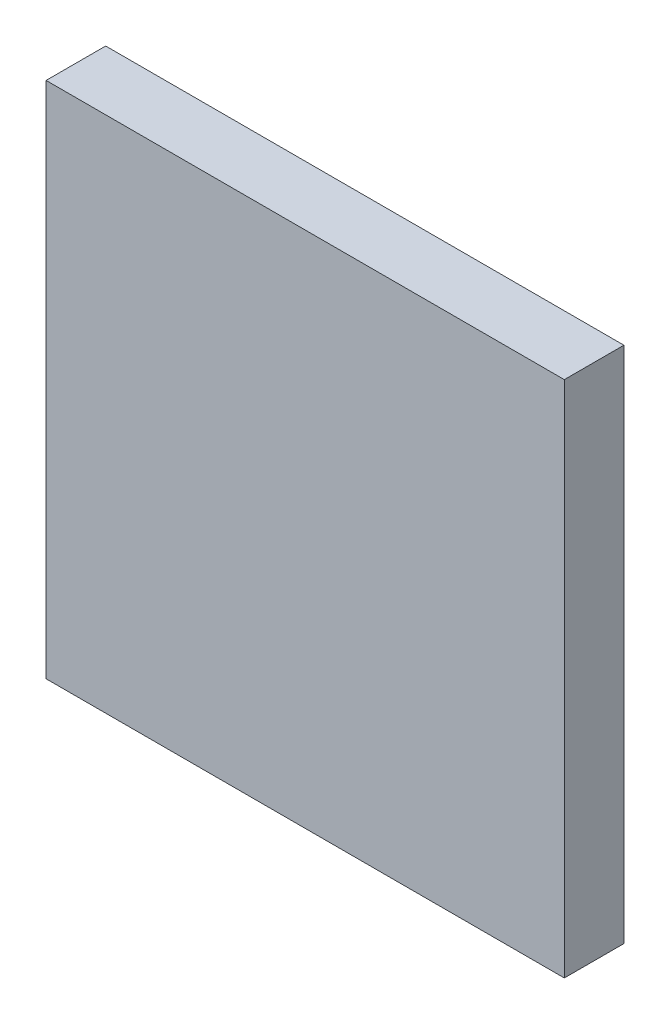
ISO-10303-21;
HEADER;
FILE_DESCRIPTION(('STEP AP214'),'2;1');
FILE_NAME('part.step','',(''),(''),'','','');
FILE_SCHEMA(('AUTOMOTIVE_DESIGN { 1 0 10303 214 1 1 1 1 }'));
ENDSEC;
DATA;
#1=APPLICATION_CONTEXT('core data for automotive mechanical design processes');
#2=APPLICATION_PROTOCOL_DEFINITION('international standard','automotive_design',2000,#1);
#3=PRODUCT_CONTEXT('',#1,'mechanical');
#4=PRODUCT('Part','Part','',(#3));
#5=PRODUCT_RELATED_PRODUCT_CATEGORY('part','',(#4));
#6=PRODUCT_DEFINITION_FORMATION('','',#4);
#7=PRODUCT_DEFINITION_CONTEXT('part definition',#1,'design');
#8=PRODUCT_DEFINITION('design','',#6,#7);
#9=PRODUCT_DEFINITION_SHAPE('','',#8);
#10=(LENGTH_UNIT() NAMED_UNIT(*) SI_UNIT(.MILLI.,.METRE.));
#11=(NAMED_UNIT(*) PLANE_ANGLE_UNIT() SI_UNIT($,.RADIAN.));
#12=(NAMED_UNIT(*) SI_UNIT($,.STERADIAN.) SOLID_ANGLE_UNIT());
#13=UNCERTAINTY_MEASURE_WITH_UNIT(LENGTH_MEASURE(1.E-05),#10,'distance_accuracy_value','');
#14=(GEOMETRIC_REPRESENTATION_CONTEXT(3) GLOBAL_UNCERTAINTY_ASSIGNED_CONTEXT((#13)) GLOBAL_UNIT_ASSIGNED_CONTEXT((#10,
#11,#12)) REPRESENTATION_CONTEXT('',''));
#15=CARTESIAN_POINT('',(0.,0.,0.));
#16=DIRECTION('',(0.,0.,1.));
#17=DIRECTION('',(1.,0.,0.));
#18=AXIS2_PLACEMENT_3D('',#15,#16,#17);
#19=CARTESIAN_POINT('',(5.00000016,5.00000016,1.15000024));
#20=DIRECTION('',(0.,0.,1.));
#21=DIRECTION('',(1.,0.,0.));
#22=AXIS2_PLACEMENT_3D('',#19,#20,#21);
#23=PLANE('',#22);
#24=DIRECTION('',(1.,0.,0.));
#25=VECTOR('',#24,1.);
#26=CARTESIAN_POINT('',(5.00000016,-5.00000016,1.15000024));
#27=LINE('',#26,#25);
#28=CARTESIAN_POINT('',(5.00000016,-5.00000016,1.15000024));
#29=VERTEX_POINT('',#28);
#30=CARTESIAN_POINT('',(-5.00000016,-5.00000016,1.15000024));
#31=VERTEX_POINT('',#30);
#32=EDGE_CURVE('E53',#29,#31,#27,.F.);
#33=ORIENTED_EDGE('',*,*,#32,.F.);
#34=DIRECTION('',(0.,1.,0.));
#35=VECTOR('',#34,1.);
#36=CARTESIAN_POINT('',(5.00000016,5.00000016,1.15000024));
#37=LINE('',#36,#35);
#38=CARTESIAN_POINT('',(5.00000016,5.00000016,1.15000024));
#39=VERTEX_POINT('',#38);
#40=EDGE_CURVE('E68',#39,#29,#37,.F.);
#41=ORIENTED_EDGE('',*,*,#40,.F.);
#42=DIRECTION('',(1.,0.,0.));
#43=VECTOR('',#42,1.);
#44=CARTESIAN_POINT('',(-5.00000016,5.00000016,1.15000024));
#45=LINE('',#44,#43);
#46=CARTESIAN_POINT('',(-5.00000016,5.00000016,1.15000024));
#47=VERTEX_POINT('',#46);
#48=EDGE_CURVE('E20',#47,#39,#45,.T.);
#49=ORIENTED_EDGE('',*,*,#48,.F.);
#50=DIRECTION('',(0.,1.,0.));
#51=VECTOR('',#50,1.);
#52=CARTESIAN_POINT('',(-5.00000016,-5.00000016,1.15000024));
#53=LINE('',#52,#51);
#54=EDGE_CURVE('E58',#31,#47,#53,.T.);
#55=ORIENTED_EDGE('',*,*,#54,.F.);
#56=EDGE_LOOP('',(#33,#41,#49,#55));
#57=FACE_BOUND('',#56,.T.);
#58=ADVANCED_FACE('F17',(#57),#23,.T.);
#59=CARTESIAN_POINT('',(-5.00000016,5.00000016,0.));
#60=DIRECTION('',(0.,1.,0.));
#61=DIRECTION('',(0.,0.,1.));
#62=AXIS2_PLACEMENT_3D('',#59,#60,#61);
#63=PLANE('',#62);
#64=DIRECTION('',(0.,0.,-1.));
#65=VECTOR('',#64,1.);
#66=CARTESIAN_POINT('',(5.00000016,5.00000016,0.));
#67=LINE('',#66,#65);
#68=CARTESIAN_POINT('',(5.00000016,5.00000016,0.));
#69=VERTEX_POINT('',#68);
#70=EDGE_CURVE('E79',#69,#39,#67,.F.);
#71=ORIENTED_EDGE('',*,*,#70,.F.);
#72=DIRECTION('',(1.,0.,0.));
#73=VECTOR('',#72,1.);
#74=CARTESIAN_POINT('',(5.00000016,5.00000016,0.));
#75=LINE('',#74,#73);
#76=CARTESIAN_POINT('',(-5.00000016,5.00000016,0.));
#77=VERTEX_POINT('',#76);
#78=EDGE_CURVE('E74',#69,#77,#75,.F.);
#79=ORIENTED_EDGE('',*,*,#78,.T.);
#80=DIRECTION('',(0.,0.,1.));
#81=VECTOR('',#80,1.);
#82=CARTESIAN_POINT('',(-5.00000016,5.00000016,0.));
#83=LINE('',#82,#81);
#84=EDGE_CURVE('E63',#47,#77,#83,.F.);
#85=ORIENTED_EDGE('',*,*,#84,.F.);
#86=ORIENTED_EDGE('',*,*,#48,.T.);
#87=EDGE_LOOP('',(#71,#79,#85,#86));
#88=FACE_BOUND('',#87,.T.);
#89=ADVANCED_FACE('F73',(#88),#63,.T.);
#90=CARTESIAN_POINT('',(-5.00000016,-5.00000016,0.));
#91=DIRECTION('',(-1.,0.,0.));
#92=DIRECTION('',(0.,0.,1.));
#93=AXIS2_PLACEMENT_3D('',#90,#91,#92);
#94=PLANE('',#93);
#95=ORIENTED_EDGE('',*,*,#84,.T.);
#96=DIRECTION('',(0.,1.,0.));
#97=VECTOR('',#96,1.);
#98=CARTESIAN_POINT('',(-5.00000016,5.00000016,0.));
#99=LINE('',#98,#97);
#100=CARTESIAN_POINT('',(-5.00000016,-5.00000016,0.));
#101=VERTEX_POINT('',#100);
#102=EDGE_CURVE('E84',#77,#101,#99,.F.);
#103=ORIENTED_EDGE('',*,*,#102,.T.);
#104=DIRECTION('',(0.,0.,-1.));
#105=VECTOR('',#104,1.);
#106=CARTESIAN_POINT('',(-5.00000016,-5.00000016,0.));
#107=LINE('',#106,#105);
#108=EDGE_CURVE('E65',#31,#101,#107,.T.);
#109=ORIENTED_EDGE('',*,*,#108,.F.);
#110=ORIENTED_EDGE('',*,*,#54,.T.);
#111=EDGE_LOOP('',(#95,#103,#109,#110));
#112=FACE_BOUND('',#111,.T.);
#113=ADVANCED_FACE('F60',(#112),#94,.T.);
#114=CARTESIAN_POINT('',(5.00000016,-5.00000016,0.));
#115=DIRECTION('',(0.,-1.,0.));
#116=DIRECTION('',(0.,0.,-1.));
#117=AXIS2_PLACEMENT_3D('',#114,#115,#116);
#118=PLANE('',#117);
#119=ORIENTED_EDGE('',*,*,#108,.T.);
#120=DIRECTION('',(1.,0.,0.));
#121=VECTOR('',#120,1.);
#122=CARTESIAN_POINT('',(5.00000016,-5.00000016,0.));
#123=LINE('',#122,#121);
#124=CARTESIAN_POINT('',(5.00000016,-5.00000016,0.));
#125=VERTEX_POINT('',#124);
#126=EDGE_CURVE('E26',#101,#125,#123,.T.);
#127=ORIENTED_EDGE('',*,*,#126,.T.);
#128=DIRECTION('',(0.,0.,-1.));
#129=VECTOR('',#128,1.);
#130=CARTESIAN_POINT('',(5.00000016,-5.00000016,0.));
#131=LINE('',#130,#129);
#132=EDGE_CURVE('E34',#29,#125,#131,.T.);
#133=ORIENTED_EDGE('',*,*,#132,.F.);
#134=ORIENTED_EDGE('',*,*,#32,.T.);
#135=EDGE_LOOP('',(#119,#127,#133,#134));
#136=FACE_BOUND('',#135,.T.);
#137=ADVANCED_FACE('F88',(#136),#118,.T.);
#138=CARTESIAN_POINT('',(5.00000016,5.00000016,0.));
#139=DIRECTION('',(1.,0.,0.));
#140=DIRECTION('',(0.,0.,-1.));
#141=AXIS2_PLACEMENT_3D('',#138,#139,#140);
#142=PLANE('',#141);
#143=ORIENTED_EDGE('',*,*,#132,.T.);
#144=DIRECTION('',(0.,1.,0.));
#145=VECTOR('',#144,1.);
#146=CARTESIAN_POINT('',(5.00000016,5.00000016,0.));
#147=LINE('',#146,#145);
#148=EDGE_CURVE('E11',#125,#69,#147,.T.);
#149=ORIENTED_EDGE('',*,*,#148,.T.);
#150=ORIENTED_EDGE('',*,*,#70,.T.);
#151=ORIENTED_EDGE('',*,*,#40,.T.);
#152=EDGE_LOOP('',(#143,#149,#150,#151));
#153=FACE_BOUND('',#152,.T.);
#154=ADVANCED_FACE('F91',(#153),#142,.T.);
#155=CARTESIAN_POINT('',(5.00000016,5.00000016,0.));
#156=DIRECTION('',(0.,0.,1.));
#157=DIRECTION('',(1.,0.,0.));
#158=AXIS2_PLACEMENT_3D('',#155,#156,#157);
#159=PLANE('',#158);
#160=ORIENTED_EDGE('',*,*,#126,.F.);
#161=ORIENTED_EDGE('',*,*,#102,.F.);
#162=ORIENTED_EDGE('',*,*,#78,.F.);
#163=ORIENTED_EDGE('',*,*,#148,.F.);
#164=EDGE_LOOP('',(#160,#161,#162,#163));
#165=FACE_BOUND('',#164,.T.);
#166=ADVANCED_FACE('F90',(#165),#159,.F.);
#167=CLOSED_SHELL('',(#58,#89,#113,#137,#154,#166));
#168=MANIFOLD_SOLID_BREP('B1',#167);
#169=ADVANCED_BREP_SHAPE_REPRESENTATION('',(#18,#168),#14);
#170=SHAPE_DEFINITION_REPRESENTATION(#9,#169);
ENDSEC;
END-ISO-10303-21;
